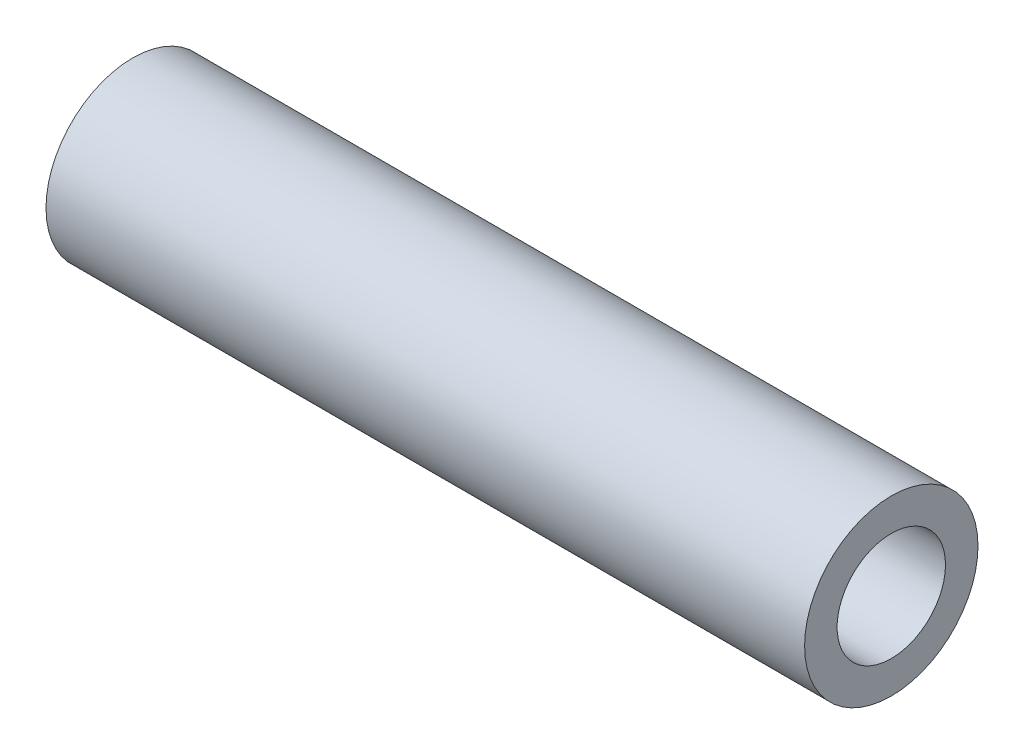
ISO-10303-21;
HEADER;
FILE_DESCRIPTION(('STEP AP214'),'2;1');
FILE_NAME('part.step','',(''),(''),'','','');
FILE_SCHEMA(('AUTOMOTIVE_DESIGN { 1 0 10303 214 1 1 1 1 }'));
ENDSEC;
DATA;
#1=APPLICATION_CONTEXT('core data for automotive mechanical design processes');
#2=APPLICATION_PROTOCOL_DEFINITION('international standard','automotive_design',2000,#1);
#3=PRODUCT_CONTEXT('',#1,'mechanical');
#4=PRODUCT('Part','Part','',(#3));
#5=PRODUCT_RELATED_PRODUCT_CATEGORY('part','',(#4));
#6=PRODUCT_DEFINITION_FORMATION('','',#4);
#7=PRODUCT_DEFINITION_CONTEXT('part definition',#1,'design');
#8=PRODUCT_DEFINITION('design','',#6,#7);
#9=PRODUCT_DEFINITION_SHAPE('','',#8);
#10=(LENGTH_UNIT() NAMED_UNIT(*) SI_UNIT(.MILLI.,.METRE.));
#11=(NAMED_UNIT(*) PLANE_ANGLE_UNIT() SI_UNIT($,.RADIAN.));
#12=(NAMED_UNIT(*) SI_UNIT($,.STERADIAN.) SOLID_ANGLE_UNIT());
#13=UNCERTAINTY_MEASURE_WITH_UNIT(LENGTH_MEASURE(1.E-05),#10,'distance_accuracy_value','');
#14=(GEOMETRIC_REPRESENTATION_CONTEXT(3) GLOBAL_UNCERTAINTY_ASSIGNED_CONTEXT((#13)) GLOBAL_UNIT_ASSIGNED_CONTEXT((#10,
#11,#12)) REPRESENTATION_CONTEXT('',''));
#15=CARTESIAN_POINT('',(0.,0.,0.));
#16=DIRECTION('',(0.,0.,1.));
#17=DIRECTION('',(1.,0.,0.));
#18=AXIS2_PLACEMENT_3D('',#15,#16,#17);
#19=CARTESIAN_POINT('',(70.,0.,0.));
#20=DIRECTION('',(1.,0.,0.));
#21=DIRECTION('',(0.,0.,-1.));
#22=AXIS2_PLACEMENT_3D('',#19,#20,#21);
#23=PLANE('',#22);
#24=CARTESIAN_POINT('',(70.,0.,0.));
#25=DIRECTION('',(1.,0.,0.));
#26=DIRECTION('',(0.,0.,-1.));
#27=AXIS2_PLACEMENT_3D('',#24,#25,#26);
#28=CIRCLE('',#27,8.);
#29=CARTESIAN_POINT('',(70.,0.,-8.));
#30=VERTEX_POINT('',#29);
#31=EDGE_CURVE('E10',#30,#30,#28,.T.);
#32=ORIENTED_EDGE('',*,*,#31,.T.);
#33=EDGE_LOOP('',(#32));
#34=FACE_BOUND('',#33,.T.);
#35=CARTESIAN_POINT('',(70.,0.,0.));
#36=DIRECTION('',(1.,0.,0.));
#37=DIRECTION('',(0.,0.,-1.));
#38=AXIS2_PLACEMENT_3D('',#35,#36,#37);
#39=CIRCLE('',#38,5.);
#40=CARTESIAN_POINT('',(70.,0.,-5.));
#41=VERTEX_POINT('',#40);
#42=EDGE_CURVE('E42',#41,#41,#39,.T.);
#43=ORIENTED_EDGE('',*,*,#42,.F.);
#44=EDGE_LOOP('',(#43));
#45=FACE_BOUND('',#44,.T.);
#46=ADVANCED_FACE('F31',(#34,#45),#23,.T.);
#47=CARTESIAN_POINT('',(0.,0.,0.));
#48=DIRECTION('',(1.,0.,0.));
#49=DIRECTION('',(0.,0.,-1.));
#50=AXIS2_PLACEMENT_3D('',#47,#48,#49);
#51=PLANE('',#50);
#52=CARTESIAN_POINT('',(0.,0.,0.));
#53=DIRECTION('',(1.,0.,0.));
#54=DIRECTION('',(0.,0.,-1.));
#55=AXIS2_PLACEMENT_3D('',#52,#53,#54);
#56=CIRCLE('',#55,8.);
#57=CARTESIAN_POINT('',(0.,0.,-8.));
#58=VERTEX_POINT('',#57);
#59=EDGE_CURVE('E35',#58,#58,#56,.T.);
#60=ORIENTED_EDGE('',*,*,#59,.F.);
#61=EDGE_LOOP('',(#60));
#62=FACE_BOUND('',#61,.T.);
#63=CARTESIAN_POINT('',(0.,0.,0.));
#64=DIRECTION('',(1.,0.,0.));
#65=DIRECTION('',(0.,0.,-1.));
#66=AXIS2_PLACEMENT_3D('',#63,#64,#65);
#67=CIRCLE('',#66,5.);
#68=CARTESIAN_POINT('',(0.,0.,-5.));
#69=VERTEX_POINT('',#68);
#70=EDGE_CURVE('E44',#69,#69,#67,.T.);
#71=ORIENTED_EDGE('',*,*,#70,.T.);
#72=EDGE_LOOP('',(#71));
#73=FACE_BOUND('',#72,.T.);
#74=ADVANCED_FACE('F54',(#62,#73),#51,.F.);
#75=CARTESIAN_POINT('',(70.,0.,0.));
#76=DIRECTION('',(-1.,0.,0.));
#77=DIRECTION('',(0.,0.,1.));
#78=AXIS2_PLACEMENT_3D('',#75,#76,#77);
#79=CYLINDRICAL_SURFACE('',#78,8.);
#80=ORIENTED_EDGE('',*,*,#31,.F.);
#81=EDGE_LOOP('',(#80));
#82=FACE_BOUND('',#81,.T.);
#83=ORIENTED_EDGE('',*,*,#59,.T.);
#84=EDGE_LOOP('',(#83));
#85=FACE_BOUND('',#84,.T.);
#86=ADVANCED_FACE('F33',(#82,#85),#79,.T.);
#87=CARTESIAN_POINT('',(70.,0.,0.));
#88=DIRECTION('',(-1.,0.,0.));
#89=DIRECTION('',(0.,0.,1.));
#90=AXIS2_PLACEMENT_3D('',#87,#88,#89);
#91=CYLINDRICAL_SURFACE('',#90,5.);
#92=ORIENTED_EDGE('',*,*,#42,.T.);
#93=EDGE_LOOP('',(#92));
#94=FACE_BOUND('',#93,.T.);
#95=ORIENTED_EDGE('',*,*,#70,.F.);
#96=EDGE_LOOP('',(#95));
#97=FACE_BOUND('',#96,.T.);
#98=ADVANCED_FACE('F50',(#94,#97),#91,.F.);
#99=CLOSED_SHELL('',(#46,#74,#86,#98));
#100=MANIFOLD_SOLID_BREP('B2',#99);
#101=ADVANCED_BREP_SHAPE_REPRESENTATION('',(#18,#100),#14);
#102=SHAPE_DEFINITION_REPRESENTATION(#9,#101);
ENDSEC;
END-ISO-10303-21;
